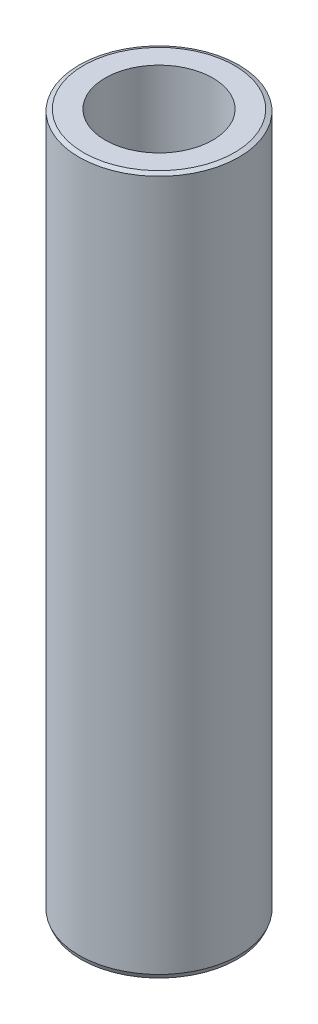
ISO-10303-21;
HEADER;
FILE_DESCRIPTION(('STEP AP214'),'2;1');
FILE_NAME('part.step','',(''),(''),'','','');
FILE_SCHEMA(('AUTOMOTIVE_DESIGN { 1 0 10303 214 1 1 1 1 }'));
ENDSEC;
DATA;
#1=APPLICATION_CONTEXT('core data for automotive mechanical design processes');
#2=APPLICATION_PROTOCOL_DEFINITION('international standard','automotive_design',2000,#1);
#3=PRODUCT_CONTEXT('',#1,'mechanical');
#4=PRODUCT('Part','Part','',(#3));
#5=PRODUCT_RELATED_PRODUCT_CATEGORY('part','',(#4));
#6=PRODUCT_DEFINITION_FORMATION('','',#4);
#7=PRODUCT_DEFINITION_CONTEXT('part definition',#1,'design');
#8=PRODUCT_DEFINITION('design','',#6,#7);
#9=PRODUCT_DEFINITION_SHAPE('','',#8);
#10=(LENGTH_UNIT() NAMED_UNIT(*) SI_UNIT(.MILLI.,.METRE.));
#11=(NAMED_UNIT(*) PLANE_ANGLE_UNIT() SI_UNIT($,.RADIAN.));
#12=(NAMED_UNIT(*) SI_UNIT($,.STERADIAN.) SOLID_ANGLE_UNIT());
#13=UNCERTAINTY_MEASURE_WITH_UNIT(LENGTH_MEASURE(1.E-05),#10,'distance_accuracy_value','');
#14=(GEOMETRIC_REPRESENTATION_CONTEXT(3) GLOBAL_UNCERTAINTY_ASSIGNED_CONTEXT((#13)) GLOBAL_UNIT_ASSIGNED_CONTEXT((#10,
#11,#12)) REPRESENTATION_CONTEXT('',''));
#15=CARTESIAN_POINT('',(0.,0.,0.));
#16=DIRECTION('',(0.,0.,1.));
#17=DIRECTION('',(1.,0.,0.));
#18=AXIS2_PLACEMENT_3D('',#15,#16,#17);
#19=CARTESIAN_POINT('',(0.,174.573456397461,0.));
#20=DIRECTION('',(0.,-1.,0.));
#21=DIRECTION('',(0.,0.,-1.));
#22=AXIS2_PLACEMENT_3D('',#19,#20,#21);
#23=CYLINDRICAL_SURFACE('',#22,20.);
#24=CARTESIAN_POINT('',(0.,174.122438394791,0.));
#25=DIRECTION('',(0.,1.,0.));
#26=DIRECTION('',(0.,0.,1.));
#27=AXIS2_PLACEMENT_3D('',#24,#25,#26);
#28=CIRCLE('',#27,20.);
#29=CARTESIAN_POINT('',(0.,174.122438394791,20.));
#30=VERTEX_POINT('',#29);
#31=EDGE_CURVE('E50',#30,#30,#28,.F.);
#32=ORIENTED_EDGE('',*,*,#31,.T.);
#33=EDGE_LOOP('',(#32));
#34=FACE_BOUND('',#33,.T.);
#35=CARTESIAN_POINT('',(0.,1.10153372003025,0.));
#36=DIRECTION('',(0.,1.,0.));
#37=DIRECTION('',(0.,0.,1.));
#38=AXIS2_PLACEMENT_3D('',#35,#36,#37);
#39=CIRCLE('',#38,20.);
#40=CARTESIAN_POINT('',(0.,1.10153372003025,20.));
#41=VERTEX_POINT('',#40);
#42=EDGE_CURVE('E51',#41,#41,#39,.T.);
#43=ORIENTED_EDGE('',*,*,#42,.T.);
#44=EDGE_LOOP('',(#43));
#45=FACE_BOUND('',#44,.T.);
#46=ADVANCED_FACE('F39',(#34,#45),#23,.T.);
#47=CARTESIAN_POINT('',(0.,174.573456397461,0.));
#48=DIRECTION('',(0.,1.,0.));
#49=DIRECTION('',(0.,0.,1.));
#50=AXIS2_PLACEMENT_3D('',#47,#48,#49);
#51=PLANE('',#50);
#52=CARTESIAN_POINT('',(0.,174.573456397461,0.));
#53=DIRECTION('',(0.,1.,0.));
#54=DIRECTION('',(0.,0.,1.));
#55=AXIS2_PLACEMENT_3D('',#52,#53,#54);
#56=CIRCLE('',#55,18.8984662799698);
#57=CARTESIAN_POINT('',(0.,174.573456397461,18.8984662799698));
#58=VERTEX_POINT('',#57);
#59=EDGE_CURVE('E54',#58,#58,#56,.T.);
#60=ORIENTED_EDGE('',*,*,#59,.T.);
#61=EDGE_LOOP('',(#60));
#62=FACE_BOUND('',#61,.T.);
#63=CARTESIAN_POINT('',(0.,174.573456397461,0.));
#64=DIRECTION('',(0.,1.,0.));
#65=DIRECTION('',(0.,0.,1.));
#66=AXIS2_PLACEMENT_3D('',#63,#64,#65);
#67=CIRCLE('',#66,13.4767113225975);
#68=CARTESIAN_POINT('',(0.,174.573456397461,13.4767113225975));
#69=VERTEX_POINT('',#68);
#70=EDGE_CURVE('E58',#69,#69,#67,.T.);
#71=ORIENTED_EDGE('',*,*,#70,.F.);
#72=EDGE_LOOP('',(#71));
#73=FACE_BOUND('',#72,.T.);
#74=ADVANCED_FACE('F69',(#62,#73),#51,.T.);
#75=CARTESIAN_POINT('',(0.,0.,0.));
#76=DIRECTION('',(0.,1.,0.));
#77=DIRECTION('',(0.,0.,1.));
#78=AXIS2_PLACEMENT_3D('',#75,#76,#77);
#79=PLANE('',#78);
#80=CARTESIAN_POINT('',(0.,0.,0.));
#81=DIRECTION('',(0.,1.,0.));
#82=DIRECTION('',(0.,0.,1.));
#83=AXIS2_PLACEMENT_3D('',#80,#81,#82);
#84=CIRCLE('',#83,19.5489819973298);
#85=CARTESIAN_POINT('',(0.,0.,19.5489819973298));
#86=VERTEX_POINT('',#85);
#87=EDGE_CURVE('E10',#86,#86,#84,.F.);
#88=ORIENTED_EDGE('',*,*,#87,.T.);
#89=EDGE_LOOP('',(#88));
#90=FACE_BOUND('',#89,.T.);
#91=CARTESIAN_POINT('',(0.,0.,0.));
#92=DIRECTION('',(0.,1.,0.));
#93=DIRECTION('',(0.,0.,1.));
#94=AXIS2_PLACEMENT_3D('',#91,#92,#93);
#95=CIRCLE('',#94,13.4767113225975);
#96=CARTESIAN_POINT('',(0.,0.,13.4767113225975));
#97=VERTEX_POINT('',#96);
#98=EDGE_CURVE('E63',#97,#97,#95,.T.);
#99=ORIENTED_EDGE('',*,*,#98,.T.);
#100=EDGE_LOOP('',(#99));
#101=FACE_BOUND('',#100,.T.);
#102=ADVANCED_FACE('F75',(#90,#101),#79,.F.);
#103=CARTESIAN_POINT('',(0.,174.573456397461,0.));
#104=DIRECTION('',(0.,-1.,0.));
#105=DIRECTION('',(0.,0.,-1.));
#106=AXIS2_PLACEMENT_3D('',#103,#104,#105);
#107=CYLINDRICAL_SURFACE('',#106,13.4767113225975);
#108=ORIENTED_EDGE('',*,*,#70,.T.);
#109=EDGE_LOOP('',(#108));
#110=FACE_BOUND('',#109,.T.);
#111=ORIENTED_EDGE('',*,*,#98,.F.);
#112=EDGE_LOOP('',(#111));
#113=FACE_BOUND('',#112,.T.);
#114=ADVANCED_FACE('F70',(#110,#113),#107,.F.);
#115=CARTESIAN_POINT('',(0.,174.573456397461,0.));
#116=DIRECTION('',(0.,-1.,0.));
#117=DIRECTION('',(0.,0.,-1.));
#118=AXIS2_PLACEMENT_3D('',#115,#116,#117);
#119=CONICAL_SURFACE('',#118,18.8984662799698,1.18217390779879);
#120=ORIENTED_EDGE('',*,*,#31,.F.);
#121=EDGE_LOOP('',(#120));
#122=FACE_BOUND('',#121,.T.);
#123=ORIENTED_EDGE('',*,*,#59,.F.);
#124=EDGE_LOOP('',(#123));
#125=FACE_BOUND('',#124,.T.);
#126=ADVANCED_FACE('F81',(#122,#125),#119,.T.);
#127=CARTESIAN_POINT('',(0.,1.10153372003025,0.));
#128=DIRECTION('',(0.,1.,0.));
#129=DIRECTION('',(0.,0.,1.));
#130=AXIS2_PLACEMENT_3D('',#127,#128,#129);
#131=CONICAL_SURFACE('',#130,20.,0.388622418996123);
#132=ORIENTED_EDGE('',*,*,#87,.F.);
#133=EDGE_LOOP('',(#132));
#134=FACE_BOUND('',#133,.T.);
#135=ORIENTED_EDGE('',*,*,#42,.F.);
#136=EDGE_LOOP('',(#135));
#137=FACE_BOUND('',#136,.T.);
#138=ADVANCED_FACE('F45',(#134,#137),#131,.T.);
#139=CLOSED_SHELL('',(#46,#74,#102,#114,#126,#138));
#140=MANIFOLD_SOLID_BREP('B2',#139);
#141=ADVANCED_BREP_SHAPE_REPRESENTATION('',(#18,#140),#14);
#142=SHAPE_DEFINITION_REPRESENTATION(#9,#141);
ENDSEC;
END-ISO-10303-21;
